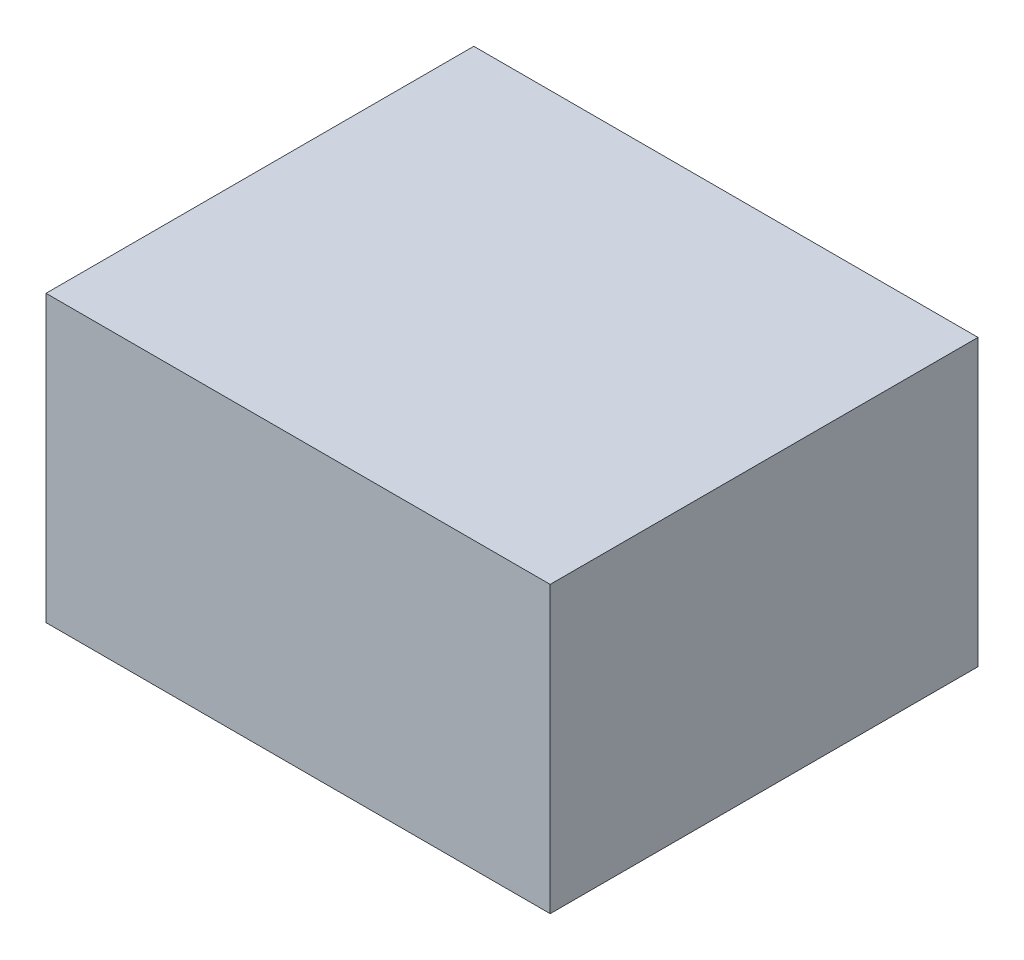
ISO-10303-21;
HEADER;
FILE_DESCRIPTION(('STEP AP214'),'2;1');
FILE_NAME('part.step','',(''),(''),'','','');
FILE_SCHEMA(('AUTOMOTIVE_DESIGN { 1 0 10303 214 1 1 1 1 }'));
ENDSEC;
DATA;
#1=APPLICATION_CONTEXT('core data for automotive mechanical design processes');
#2=APPLICATION_PROTOCOL_DEFINITION('international standard','automotive_design',2000,#1);
#3=PRODUCT_CONTEXT('',#1,'mechanical');
#4=PRODUCT('Part','Part','',(#3));
#5=PRODUCT_RELATED_PRODUCT_CATEGORY('part','',(#4));
#6=PRODUCT_DEFINITION_FORMATION('','',#4);
#7=PRODUCT_DEFINITION_CONTEXT('part definition',#1,'design');
#8=PRODUCT_DEFINITION('design','',#6,#7);
#9=PRODUCT_DEFINITION_SHAPE('','',#8);
#10=(LENGTH_UNIT() NAMED_UNIT(*) SI_UNIT(.MILLI.,.METRE.));
#11=(NAMED_UNIT(*) PLANE_ANGLE_UNIT() SI_UNIT($,.RADIAN.));
#12=(NAMED_UNIT(*) SI_UNIT($,.STERADIAN.) SOLID_ANGLE_UNIT());
#13=UNCERTAINTY_MEASURE_WITH_UNIT(LENGTH_MEASURE(1.E-05),#10,'distance_accuracy_value','');
#14=(GEOMETRIC_REPRESENTATION_CONTEXT(3) GLOBAL_UNCERTAINTY_ASSIGNED_CONTEXT((#13)) GLOBAL_UNIT_ASSIGNED_CONTEXT((#10,
#11,#12)) REPRESENTATION_CONTEXT('',''));
#15=CARTESIAN_POINT('',(0.,0.,0.));
#16=DIRECTION('',(0.,0.,1.));
#17=DIRECTION('',(1.,0.,0.));
#18=AXIS2_PLACEMENT_3D('',#15,#16,#17);
#19=CARTESIAN_POINT('',(0.,0.,4.65));
#20=DIRECTION('',(0.,0.,1.));
#21=DIRECTION('',(1.,0.,0.));
#22=AXIS2_PLACEMENT_3D('',#19,#20,#21);
#23=PLANE('',#22);
#24=DIRECTION('',(1.,0.,0.));
#25=VECTOR('',#24,1.);
#26=CARTESIAN_POINT('',(-2.74,-1.55,4.65));
#27=LINE('',#26,#25);
#28=CARTESIAN_POINT('',(-2.74,-1.55,4.65));
#29=VERTEX_POINT('',#28);
#30=CARTESIAN_POINT('',(2.74,-1.55,4.65));
#31=VERTEX_POINT('',#30);
#32=EDGE_CURVE('E79',#29,#31,#27,.T.);
#33=ORIENTED_EDGE('',*,*,#32,.T.);
#34=DIRECTION('',(0.,1.,0.));
#35=VECTOR('',#34,1.);
#36=CARTESIAN_POINT('',(2.74,-1.55,4.65));
#37=LINE('',#36,#35);
#38=CARTESIAN_POINT('',(2.74,1.55,4.65));
#39=VERTEX_POINT('',#38);
#40=EDGE_CURVE('E77',#31,#39,#37,.T.);
#41=ORIENTED_EDGE('',*,*,#40,.T.);
#42=DIRECTION('',(-1.,0.,0.));
#43=VECTOR('',#42,1.);
#44=CARTESIAN_POINT('',(2.74,1.55,4.65));
#45=LINE('',#44,#43);
#46=CARTESIAN_POINT('',(-2.74,1.55,4.65));
#47=VERTEX_POINT('',#46);
#48=EDGE_CURVE('E66',#39,#47,#45,.T.);
#49=ORIENTED_EDGE('',*,*,#48,.T.);
#50=DIRECTION('',(0.,-1.,0.));
#51=VECTOR('',#50,1.);
#52=CARTESIAN_POINT('',(-2.74,1.55,4.65));
#53=LINE('',#52,#51);
#54=EDGE_CURVE('E11',#47,#29,#53,.T.);
#55=ORIENTED_EDGE('',*,*,#54,.T.);
#56=EDGE_LOOP('',(#33,#41,#49,#55));
#57=FACE_BOUND('',#56,.T.);
#58=ADVANCED_FACE('F17',(#57),#23,.T.);
#59=CARTESIAN_POINT('',(0.,0.,0.));
#60=DIRECTION('',(0.,0.,1.));
#61=DIRECTION('',(1.,0.,0.));
#62=AXIS2_PLACEMENT_3D('',#59,#60,#61);
#63=PLANE('',#62);
#64=DIRECTION('',(0.,-1.,0.));
#65=VECTOR('',#64,1.);
#66=CARTESIAN_POINT('',(-2.74,1.55,0.));
#67=LINE('',#66,#65);
#68=CARTESIAN_POINT('',(-2.74,1.55,0.));
#69=VERTEX_POINT('',#68);
#70=CARTESIAN_POINT('',(-2.74,-1.55,0.));
#71=VERTEX_POINT('',#70);
#72=EDGE_CURVE('E26',#69,#71,#67,.T.);
#73=ORIENTED_EDGE('',*,*,#72,.F.);
#74=DIRECTION('',(-1.,0.,0.));
#75=VECTOR('',#74,1.);
#76=CARTESIAN_POINT('',(2.74,1.55,0.));
#77=LINE('',#76,#75);
#78=CARTESIAN_POINT('',(2.74,1.55,0.));
#79=VERTEX_POINT('',#78);
#80=EDGE_CURVE('E59',#79,#69,#77,.T.);
#81=ORIENTED_EDGE('',*,*,#80,.F.);
#82=DIRECTION('',(0.,1.,0.));
#83=VECTOR('',#82,1.);
#84=CARTESIAN_POINT('',(2.74,-1.55,0.));
#85=LINE('',#84,#83);
#86=CARTESIAN_POINT('',(2.74,-1.55,0.));
#87=VERTEX_POINT('',#86);
#88=EDGE_CURVE('E86',#87,#79,#85,.T.);
#89=ORIENTED_EDGE('',*,*,#88,.F.);
#90=DIRECTION('',(1.,0.,0.));
#91=VECTOR('',#90,1.);
#92=CARTESIAN_POINT('',(-2.74,-1.55,0.));
#93=LINE('',#92,#91);
#94=EDGE_CURVE('E110',#71,#87,#93,.T.);
#95=ORIENTED_EDGE('',*,*,#94,.F.);
#96=EDGE_LOOP('',(#73,#81,#89,#95));
#97=FACE_BOUND('',#96,.T.);
#98=ADVANCED_FACE('F112',(#97),#63,.F.);
#99=CARTESIAN_POINT('',(-2.74,1.55,0.));
#100=DIRECTION('',(1.,0.,0.));
#101=DIRECTION('',(0.,1.,0.));
#102=AXIS2_PLACEMENT_3D('',#99,#100,#101);
#103=PLANE('',#102);
#104=ORIENTED_EDGE('',*,*,#72,.T.);
#105=DIRECTION('',(0.,0.,1.));
#106=VECTOR('',#105,1.);
#107=CARTESIAN_POINT('',(-2.74,-1.55,0.));
#108=LINE('',#107,#106);
#109=EDGE_CURVE('E93',#71,#29,#108,.T.);
#110=ORIENTED_EDGE('',*,*,#109,.T.);
#111=ORIENTED_EDGE('',*,*,#54,.F.);
#112=DIRECTION('',(0.,0.,1.));
#113=VECTOR('',#112,1.);
#114=CARTESIAN_POINT('',(-2.74,1.55,0.));
#115=LINE('',#114,#113);
#116=EDGE_CURVE('E72',#69,#47,#115,.T.);
#117=ORIENTED_EDGE('',*,*,#116,.F.);
#118=EDGE_LOOP('',(#104,#110,#111,#117));
#119=FACE_BOUND('',#118,.T.);
#120=ADVANCED_FACE('F104',(#119),#103,.F.);
#121=CARTESIAN_POINT('',(2.74,1.55,0.));
#122=DIRECTION('',(0.,-1.,0.));
#123=DIRECTION('',(0.,0.,-1.));
#124=AXIS2_PLACEMENT_3D('',#121,#122,#123);
#125=PLANE('',#124);
#126=ORIENTED_EDGE('',*,*,#80,.T.);
#127=ORIENTED_EDGE('',*,*,#116,.T.);
#128=ORIENTED_EDGE('',*,*,#48,.F.);
#129=DIRECTION('',(0.,0.,1.));
#130=VECTOR('',#129,1.);
#131=CARTESIAN_POINT('',(2.74,1.55,0.));
#132=LINE('',#131,#130);
#133=EDGE_CURVE('E70',#79,#39,#132,.T.);
#134=ORIENTED_EDGE('',*,*,#133,.F.);
#135=EDGE_LOOP('',(#126,#127,#128,#134));
#136=FACE_BOUND('',#135,.T.);
#137=ADVANCED_FACE('F68',(#136),#125,.F.);
#138=CARTESIAN_POINT('',(2.74,-1.55,0.));
#139=DIRECTION('',(-1.,0.,0.));
#140=DIRECTION('',(0.,0.,1.));
#141=AXIS2_PLACEMENT_3D('',#138,#139,#140);
#142=PLANE('',#141);
#143=ORIENTED_EDGE('',*,*,#88,.T.);
#144=ORIENTED_EDGE('',*,*,#133,.T.);
#145=ORIENTED_EDGE('',*,*,#40,.F.);
#146=DIRECTION('',(0.,0.,1.));
#147=VECTOR('',#146,1.);
#148=CARTESIAN_POINT('',(2.74,-1.55,0.));
#149=LINE('',#148,#147);
#150=EDGE_CURVE('E114',#87,#31,#149,.T.);
#151=ORIENTED_EDGE('',*,*,#150,.F.);
#152=EDGE_LOOP('',(#143,#144,#145,#151));
#153=FACE_BOUND('',#152,.T.);
#154=ADVANCED_FACE('F85',(#153),#142,.F.);
#155=CARTESIAN_POINT('',(-2.74,-1.55,0.));
#156=DIRECTION('',(0.,1.,0.));
#157=DIRECTION('',(1.,0.,0.));
#158=AXIS2_PLACEMENT_3D('',#155,#156,#157);
#159=PLANE('',#158);
#160=ORIENTED_EDGE('',*,*,#94,.T.);
#161=ORIENTED_EDGE('',*,*,#150,.T.);
#162=ORIENTED_EDGE('',*,*,#32,.F.);
#163=ORIENTED_EDGE('',*,*,#109,.F.);
#164=EDGE_LOOP('',(#160,#161,#162,#163));
#165=FACE_BOUND('',#164,.T.);
#166=ADVANCED_FACE('F109',(#165),#159,.F.);
#167=CLOSED_SHELL('',(#58,#98,#120,#137,#154,#166));
#168=MANIFOLD_SOLID_BREP('B1',#167);
#169=ADVANCED_BREP_SHAPE_REPRESENTATION('',(#18,#168),#14);
#170=SHAPE_DEFINITION_REPRESENTATION(#9,#169);
ENDSEC;
END-ISO-10303-21;
